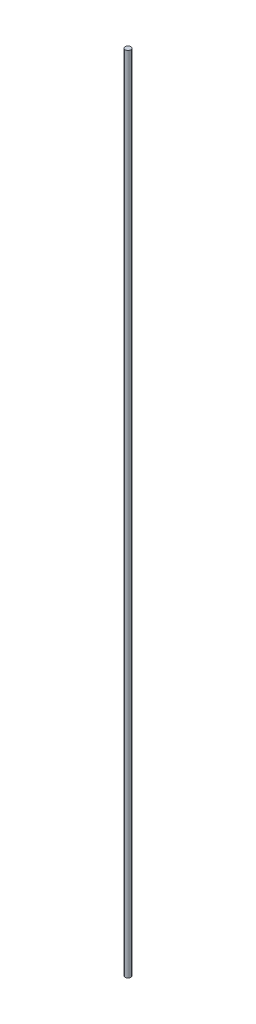
ISO-10303-21;
HEADER;
FILE_DESCRIPTION(('STEP AP214'),'2;1');
FILE_NAME('part.step','',(''),(''),'','','');
FILE_SCHEMA(('AUTOMOTIVE_DESIGN { 1 0 10303 214 1 1 1 1 }'));
ENDSEC;
DATA;
#1=APPLICATION_CONTEXT('core data for automotive mechanical design processes');
#2=APPLICATION_PROTOCOL_DEFINITION('international standard','automotive_design',2000,#1);
#3=PRODUCT_CONTEXT('',#1,'mechanical');
#4=PRODUCT('Part','Part','',(#3));
#5=PRODUCT_RELATED_PRODUCT_CATEGORY('part','',(#4));
#6=PRODUCT_DEFINITION_FORMATION('','',#4);
#7=PRODUCT_DEFINITION_CONTEXT('part definition',#1,'design');
#8=PRODUCT_DEFINITION('design','',#6,#7);
#9=PRODUCT_DEFINITION_SHAPE('','',#8);
#10=(LENGTH_UNIT() NAMED_UNIT(*) SI_UNIT(.MILLI.,.METRE.));
#11=(NAMED_UNIT(*) PLANE_ANGLE_UNIT() SI_UNIT($,.RADIAN.));
#12=(NAMED_UNIT(*) SI_UNIT($,.STERADIAN.) SOLID_ANGLE_UNIT());
#13=UNCERTAINTY_MEASURE_WITH_UNIT(LENGTH_MEASURE(1.E-05),#10,'distance_accuracy_value','');
#14=(GEOMETRIC_REPRESENTATION_CONTEXT(3) GLOBAL_UNCERTAINTY_ASSIGNED_CONTEXT((#13)) GLOBAL_UNIT_ASSIGNED_CONTEXT((#10,
#11,#12)) REPRESENTATION_CONTEXT('',''));
#15=CARTESIAN_POINT('',(0.,0.,0.));
#16=DIRECTION('',(0.,0.,1.));
#17=DIRECTION('',(1.,0.,0.));
#18=AXIS2_PLACEMENT_3D('',#15,#16,#17);
#19=CARTESIAN_POINT('',(0.,588.,0.));
#20=DIRECTION('',(0.,-1.,0.));
#21=DIRECTION('',(0.,0.,-1.));
#22=AXIS2_PLACEMENT_3D('',#19,#20,#21);
#23=CYLINDRICAL_SURFACE('',#22,2.);
#24=CARTESIAN_POINT('',(0.,588.,0.));
#25=DIRECTION('',(0.,1.,0.));
#26=DIRECTION('',(0.,0.,1.));
#27=AXIS2_PLACEMENT_3D('',#24,#25,#26);
#28=CIRCLE('',#27,2.);
#29=CARTESIAN_POINT('',(0.,588.,2.));
#30=VERTEX_POINT('',#29);
#31=EDGE_CURVE('E10',#30,#30,#28,.T.);
#32=ORIENTED_EDGE('',*,*,#31,.F.);
#33=EDGE_LOOP('',(#32));
#34=FACE_BOUND('',#33,.T.);
#35=CARTESIAN_POINT('',(0.,0.,0.));
#36=DIRECTION('',(0.,1.,0.));
#37=DIRECTION('',(0.,0.,1.));
#38=AXIS2_PLACEMENT_3D('',#35,#36,#37);
#39=CIRCLE('',#38,2.);
#40=CARTESIAN_POINT('',(0.,0.,2.));
#41=VERTEX_POINT('',#40);
#42=EDGE_CURVE('E48',#41,#41,#39,.T.);
#43=ORIENTED_EDGE('',*,*,#42,.T.);
#44=EDGE_LOOP('',(#43));
#45=FACE_BOUND('',#44,.T.);
#46=ADVANCED_FACE('F45',(#34,#45),#23,.T.);
#47=CARTESIAN_POINT('',(0.,588.,0.));
#48=DIRECTION('',(0.,1.,0.));
#49=DIRECTION('',(0.,0.,1.));
#50=AXIS2_PLACEMENT_3D('',#47,#48,#49);
#51=PLANE('',#50);
#52=ORIENTED_EDGE('',*,*,#31,.T.);
#53=EDGE_LOOP('',(#52));
#54=FACE_BOUND('',#53,.T.);
#55=ADVANCED_FACE('F62',(#54),#51,.T.);
#56=CARTESIAN_POINT('',(0.,0.,0.));
#57=DIRECTION('',(0.,1.,0.));
#58=DIRECTION('',(0.,0.,1.));
#59=AXIS2_PLACEMENT_3D('',#56,#57,#58);
#60=PLANE('',#59);
#61=ORIENTED_EDGE('',*,*,#42,.F.);
#62=EDGE_LOOP('',(#61));
#63=FACE_BOUND('',#62,.T.);
#64=ADVANCED_FACE('F60',(#63),#60,.F.);
#65=CLOSED_SHELL('',(#46,#55,#64));
#66=MANIFOLD_SOLID_BREP('B2',#65);
#67=ADVANCED_BREP_SHAPE_REPRESENTATION('',(#18,#66),#14);
#68=SHAPE_DEFINITION_REPRESENTATION(#9,#67);
ENDSEC;
END-ISO-10303-21;
